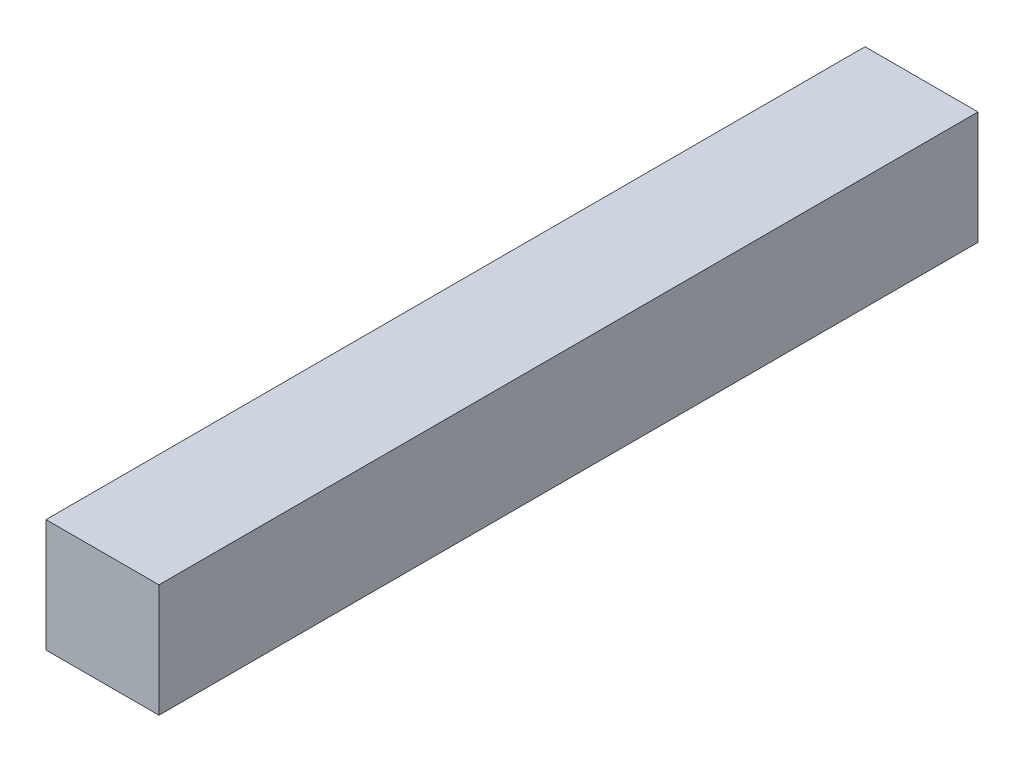
ISO-10303-21;
HEADER;
FILE_DESCRIPTION(('STEP AP214'),'2;1');
FILE_NAME('part.step','',(''),(''),'','','');
FILE_SCHEMA(('AUTOMOTIVE_DESIGN { 1 0 10303 214 1 1 1 1 }'));
ENDSEC;
DATA;
#1=APPLICATION_CONTEXT('core data for automotive mechanical design processes');
#2=APPLICATION_PROTOCOL_DEFINITION('international standard','automotive_design',2000,#1);
#3=PRODUCT_CONTEXT('',#1,'mechanical');
#4=PRODUCT('Part','Part','',(#3));
#5=PRODUCT_RELATED_PRODUCT_CATEGORY('part','',(#4));
#6=PRODUCT_DEFINITION_FORMATION('','',#4);
#7=PRODUCT_DEFINITION_CONTEXT('part definition',#1,'design');
#8=PRODUCT_DEFINITION('design','',#6,#7);
#9=PRODUCT_DEFINITION_SHAPE('','',#8);
#10=(LENGTH_UNIT() NAMED_UNIT(*) SI_UNIT(.MILLI.,.METRE.));
#11=(NAMED_UNIT(*) PLANE_ANGLE_UNIT() SI_UNIT($,.RADIAN.));
#12=(NAMED_UNIT(*) SI_UNIT($,.STERADIAN.) SOLID_ANGLE_UNIT());
#13=UNCERTAINTY_MEASURE_WITH_UNIT(LENGTH_MEASURE(1.E-05),#10,'distance_accuracy_value','');
#14=(GEOMETRIC_REPRESENTATION_CONTEXT(3) GLOBAL_UNCERTAINTY_ASSIGNED_CONTEXT((#13)) GLOBAL_UNIT_ASSIGNED_CONTEXT((#10,
#11,#12)) REPRESENTATION_CONTEXT('',''));
#15=CARTESIAN_POINT('',(0.,0.,0.));
#16=DIRECTION('',(0.,0.,1.));
#17=DIRECTION('',(1.,0.,0.));
#18=AXIS2_PLACEMENT_3D('',#15,#16,#17);
#19=CARTESIAN_POINT('',(16.6867469879518,20.,-38.2153614457831));
#20=DIRECTION('',(1.,0.,0.));
#21=DIRECTION('',(0.,0.,-1.));
#22=AXIS2_PLACEMENT_3D('',#19,#20,#21);
#23=PLANE('',#22);
#24=DIRECTION('',(0.,0.,1.));
#25=VECTOR('',#24,1.);
#26=CARTESIAN_POINT('',(16.6867469879518,0.,-38.2153614457831));
#27=LINE('',#26,#25);
#28=CARTESIAN_POINT('',(16.6867469879518,0.,-38.2153614457831));
#29=VERTEX_POINT('',#28);
#30=CARTESIAN_POINT('',(16.6867469879518,0.,106.784638554217));
#31=VERTEX_POINT('',#30);
#32=EDGE_CURVE('E113',#29,#31,#27,.T.);
#33=ORIENTED_EDGE('',*,*,#32,.T.);
#34=DIRECTION('',(0.,-1.,0.));
#35=VECTOR('',#34,1.);
#36=CARTESIAN_POINT('',(16.6867469879518,20.,106.784638554217));
#37=LINE('',#36,#35);
#38=CARTESIAN_POINT('',(16.6867469879518,20.,106.784638554217));
#39=VERTEX_POINT('',#38);
#40=EDGE_CURVE('E11',#39,#31,#37,.T.);
#41=ORIENTED_EDGE('',*,*,#40,.F.);
#42=DIRECTION('',(0.,0.,1.));
#43=VECTOR('',#42,1.);
#44=CARTESIAN_POINT('',(16.6867469879518,20.,-38.2153614457831));
#45=LINE('',#44,#43);
#46=CARTESIAN_POINT('',(16.6867469879518,20.,-38.2153614457831));
#47=VERTEX_POINT('',#46);
#48=EDGE_CURVE('E97',#47,#39,#45,.T.);
#49=ORIENTED_EDGE('',*,*,#48,.F.);
#50=DIRECTION('',(0.,-1.,0.));
#51=VECTOR('',#50,1.);
#52=CARTESIAN_POINT('',(16.6867469879518,20.,-38.2153614457831));
#53=LINE('',#52,#51);
#54=EDGE_CURVE('E109',#47,#29,#53,.T.);
#55=ORIENTED_EDGE('',*,*,#54,.T.);
#56=EDGE_LOOP('',(#33,#41,#49,#55));
#57=FACE_BOUND('',#56,.T.);
#58=ADVANCED_FACE('F45',(#57),#23,.F.);
#59=CARTESIAN_POINT('',(16.6867469879518,20.,106.784638554217));
#60=DIRECTION('',(0.,0.,-1.));
#61=DIRECTION('',(-1.,0.,0.));
#62=AXIS2_PLACEMENT_3D('',#59,#60,#61);
#63=PLANE('',#62);
#64=DIRECTION('',(1.,0.,0.));
#65=VECTOR('',#64,1.);
#66=CARTESIAN_POINT('',(16.6867469879518,0.,106.784638554217));
#67=LINE('',#66,#65);
#68=CARTESIAN_POINT('',(36.6867469879518,0.,106.784638554217));
#69=VERTEX_POINT('',#68);
#70=EDGE_CURVE('E102',#31,#69,#67,.T.);
#71=ORIENTED_EDGE('',*,*,#70,.T.);
#72=DIRECTION('',(0.,-1.,0.));
#73=VECTOR('',#72,1.);
#74=CARTESIAN_POINT('',(36.6867469879518,20.,106.784638554217));
#75=LINE('',#74,#73);
#76=CARTESIAN_POINT('',(36.6867469879518,20.,106.784638554217));
#77=VERTEX_POINT('',#76);
#78=EDGE_CURVE('E54',#77,#69,#75,.T.);
#79=ORIENTED_EDGE('',*,*,#78,.F.);
#80=DIRECTION('',(1.,0.,0.));
#81=VECTOR('',#80,1.);
#82=CARTESIAN_POINT('',(16.6867469879518,20.,106.784638554217));
#83=LINE('',#82,#81);
#84=EDGE_CURVE('E92',#39,#77,#83,.T.);
#85=ORIENTED_EDGE('',*,*,#84,.F.);
#86=ORIENTED_EDGE('',*,*,#40,.T.);
#87=EDGE_LOOP('',(#71,#79,#85,#86));
#88=FACE_BOUND('',#87,.T.);
#89=ADVANCED_FACE('F101',(#88),#63,.F.);
#90=CARTESIAN_POINT('',(36.6867469879518,20.,-38.2153614457831));
#91=DIRECTION('',(-1.,0.,0.));
#92=DIRECTION('',(0.,0.,1.));
#93=AXIS2_PLACEMENT_3D('',#90,#91,#92);
#94=PLANE('',#93);
#95=DIRECTION('',(0.,0.,-1.));
#96=VECTOR('',#95,1.);
#97=CARTESIAN_POINT('',(36.6867469879518,0.,-38.2153614457831));
#98=LINE('',#97,#96);
#99=CARTESIAN_POINT('',(36.6867469879518,0.,-38.2153614457831));
#100=VERTEX_POINT('',#99);
#101=EDGE_CURVE('E79',#69,#100,#98,.T.);
#102=ORIENTED_EDGE('',*,*,#101,.T.);
#103=DIRECTION('',(0.,-1.,0.));
#104=VECTOR('',#103,1.);
#105=CARTESIAN_POINT('',(36.6867469879518,20.,-38.2153614457831));
#106=LINE('',#105,#104);
#107=CARTESIAN_POINT('',(36.6867469879518,20.,-38.2153614457831));
#108=VERTEX_POINT('',#107);
#109=EDGE_CURVE('E104',#108,#100,#106,.T.);
#110=ORIENTED_EDGE('',*,*,#109,.F.);
#111=DIRECTION('',(0.,0.,-1.));
#112=VECTOR('',#111,1.);
#113=CARTESIAN_POINT('',(36.6867469879518,20.,-38.2153614457831));
#114=LINE('',#113,#112);
#115=EDGE_CURVE('E95',#77,#108,#114,.T.);
#116=ORIENTED_EDGE('',*,*,#115,.F.);
#117=ORIENTED_EDGE('',*,*,#78,.T.);
#118=EDGE_LOOP('',(#102,#110,#116,#117));
#119=FACE_BOUND('',#118,.T.);
#120=ADVANCED_FACE('F105',(#119),#94,.F.);
#121=CARTESIAN_POINT('',(16.6867469879518,20.,-38.2153614457831));
#122=DIRECTION('',(0.,0.,1.));
#123=DIRECTION('',(1.,0.,0.));
#124=AXIS2_PLACEMENT_3D('',#121,#122,#123);
#125=PLANE('',#124);
#126=DIRECTION('',(-1.,0.,0.));
#127=VECTOR('',#126,1.);
#128=CARTESIAN_POINT('',(16.6867469879518,0.,-38.2153614457831));
#129=LINE('',#128,#127);
#130=EDGE_CURVE('E85',#100,#29,#129,.T.);
#131=ORIENTED_EDGE('',*,*,#130,.T.);
#132=ORIENTED_EDGE('',*,*,#54,.F.);
#133=DIRECTION('',(-1.,0.,0.));
#134=VECTOR('',#133,1.);
#135=CARTESIAN_POINT('',(16.6867469879518,20.,-38.2153614457831));
#136=LINE('',#135,#134);
#137=EDGE_CURVE('E62',#108,#47,#136,.T.);
#138=ORIENTED_EDGE('',*,*,#137,.F.);
#139=ORIENTED_EDGE('',*,*,#109,.T.);
#140=EDGE_LOOP('',(#131,#132,#138,#139));
#141=FACE_BOUND('',#140,.T.);
#142=ADVANCED_FACE('F126',(#141),#125,.F.);
#143=CARTESIAN_POINT('',(0.,20.,0.));
#144=DIRECTION('',(0.,1.,0.));
#145=DIRECTION('',(0.,0.,1.));
#146=AXIS2_PLACEMENT_3D('',#143,#144,#145);
#147=PLANE('',#146);
#148=ORIENTED_EDGE('',*,*,#48,.T.);
#149=ORIENTED_EDGE('',*,*,#84,.T.);
#150=ORIENTED_EDGE('',*,*,#115,.T.);
#151=ORIENTED_EDGE('',*,*,#137,.T.);
#152=EDGE_LOOP('',(#148,#149,#150,#151));
#153=FACE_BOUND('',#152,.T.);
#154=ADVANCED_FACE('F93',(#153),#147,.T.);
#155=CARTESIAN_POINT('',(0.,0.,0.));
#156=DIRECTION('',(0.,1.,0.));
#157=DIRECTION('',(0.,0.,1.));
#158=AXIS2_PLACEMENT_3D('',#155,#156,#157);
#159=PLANE('',#158);
#160=ORIENTED_EDGE('',*,*,#32,.F.);
#161=ORIENTED_EDGE('',*,*,#130,.F.);
#162=ORIENTED_EDGE('',*,*,#101,.F.);
#163=ORIENTED_EDGE('',*,*,#70,.F.);
#164=EDGE_LOOP('',(#160,#161,#162,#163));
#165=FACE_BOUND('',#164,.T.);
#166=ADVANCED_FACE('F129',(#165),#159,.F.);
#167=CLOSED_SHELL('',(#58,#89,#120,#142,#154,#166));
#168=MANIFOLD_SOLID_BREP('B2',#167);
#169=ADVANCED_BREP_SHAPE_REPRESENTATION('',(#18,#168),#14);
#170=SHAPE_DEFINITION_REPRESENTATION(#9,#169);
ENDSEC;
END-ISO-10303-21;
